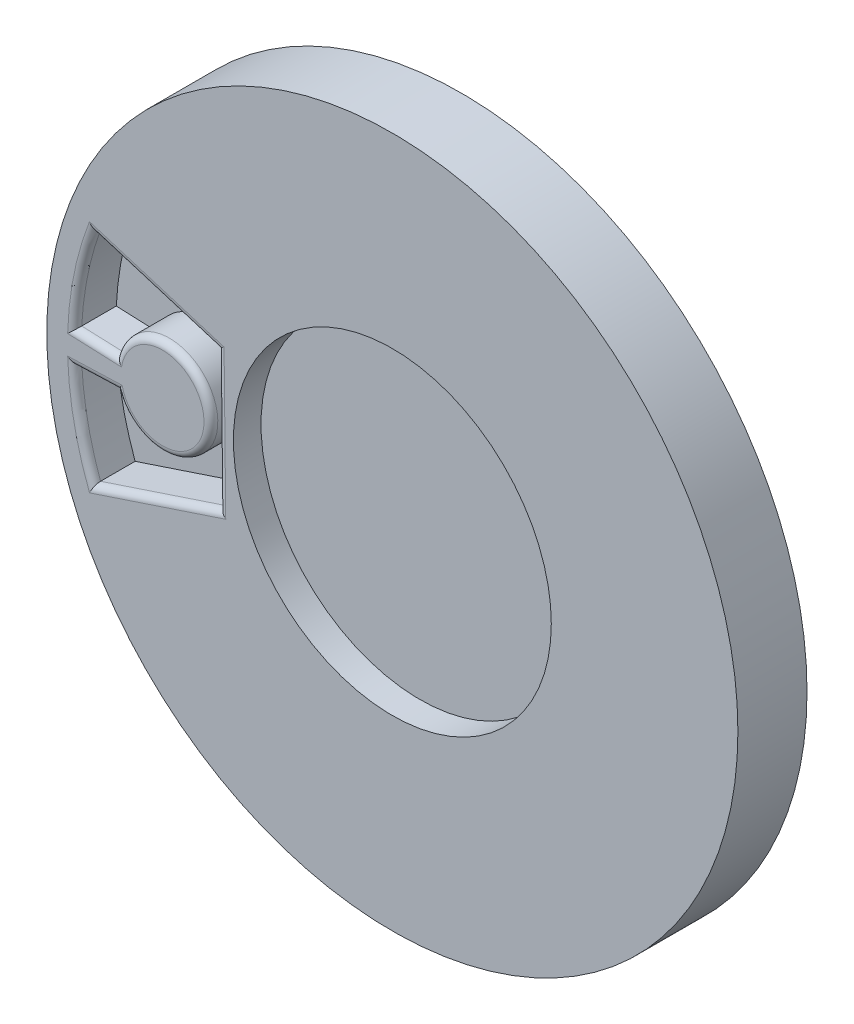
ISO-10303-21;
HEADER;
FILE_DESCRIPTION(('STEP AP214'),'2;1');
FILE_NAME('part.step','',(''),(''),'','','');
FILE_SCHEMA(('AUTOMOTIVE_DESIGN { 1 0 10303 214 1 1 1 1 }'));
ENDSEC;
DATA;
#1=APPLICATION_CONTEXT('core data for automotive mechanical design processes');
#2=APPLICATION_PROTOCOL_DEFINITION('international standard','automotive_design',2000,#1);
#3=PRODUCT_CONTEXT('',#1,'mechanical');
#4=PRODUCT('Part','Part','',(#3));
#5=PRODUCT_RELATED_PRODUCT_CATEGORY('part','',(#4));
#6=PRODUCT_DEFINITION_FORMATION('','',#4);
#7=PRODUCT_DEFINITION_CONTEXT('part definition',#1,'design');
#8=PRODUCT_DEFINITION('design','',#6,#7);
#9=PRODUCT_DEFINITION_SHAPE('','',#8);
#10=(LENGTH_UNIT() NAMED_UNIT(*) SI_UNIT(.MILLI.,.METRE.));
#11=(NAMED_UNIT(*) PLANE_ANGLE_UNIT() SI_UNIT($,.RADIAN.));
#12=(NAMED_UNIT(*) SI_UNIT($,.STERADIAN.) SOLID_ANGLE_UNIT());
#13=UNCERTAINTY_MEASURE_WITH_UNIT(LENGTH_MEASURE(1.E-05),#10,'distance_accuracy_value','');
#14=(GEOMETRIC_REPRESENTATION_CONTEXT(3) GLOBAL_UNCERTAINTY_ASSIGNED_CONTEXT((#13)) GLOBAL_UNIT_ASSIGNED_CONTEXT((#10,
#11,#12)) REPRESENTATION_CONTEXT('',''));
#15=CARTESIAN_POINT('',(0.,0.,0.));
#16=DIRECTION('',(0.,0.,1.));
#17=DIRECTION('',(1.,0.,0.));
#18=AXIS2_PLACEMENT_3D('',#15,#16,#17);
#19=CARTESIAN_POINT('',(0.,0.,-10.));
#20=DIRECTION('',(0.,0.,1.));
#21=DIRECTION('',(1.,0.,0.));
#22=AXIS2_PLACEMENT_3D('',#19,#20,#21);
#23=CYLINDRICAL_SURFACE('',#22,4.);
#24=CARTESIAN_POINT('',(0.,0.,0.));
#25=DIRECTION('',(0.,0.,1.));
#26=DIRECTION('',(1.,0.,0.));
#27=AXIS2_PLACEMENT_3D('',#24,#25,#26);
#28=CIRCLE('',#27,4.);
#29=CARTESIAN_POINT('',(4.,0.,0.));
#30=VERTEX_POINT('',#29);
#31=EDGE_CURVE('E181',#30,#30,#28,.T.);
#32=ORIENTED_EDGE('',*,*,#31,.F.);
#33=EDGE_LOOP('',(#32));
#34=FACE_BOUND('',#33,.T.);
#35=CARTESIAN_POINT('',(0.,0.,-10.));
#36=DIRECTION('',(0.,0.,1.));
#37=DIRECTION('',(1.,0.,0.));
#38=AXIS2_PLACEMENT_3D('',#35,#36,#37);
#39=CIRCLE('',#38,4.);
#40=CARTESIAN_POINT('',(-0.600000000000001,3.95474398665704,-10.));
#41=VERTEX_POINT('',#40);
#42=CARTESIAN_POINT('',(-0.6,-3.95474398665704,-10.));
#43=VERTEX_POINT('',#42);
#44=EDGE_CURVE('E180',#41,#43,#39,.T.);
#45=ORIENTED_EDGE('',*,*,#44,.T.);
#46=DIRECTION('',(0.,0.,1.));
#47=VECTOR('',#46,1.);
#48=CARTESIAN_POINT('',(-0.6,-3.95474398665704,-10.));
#49=LINE('',#48,#47);
#50=CARTESIAN_POINT('',(-0.6,-3.95474398665704,-5.));
#51=VERTEX_POINT('',#50);
#52=EDGE_CURVE('E176',#43,#51,#49,.T.);
#53=ORIENTED_EDGE('',*,*,#52,.T.);
#54=CARTESIAN_POINT('',(0.,0.,-5.));
#55=DIRECTION('',(0.,0.,1.));
#56=DIRECTION('',(1.,0.,0.));
#57=AXIS2_PLACEMENT_3D('',#54,#55,#56);
#58=CIRCLE('',#57,4.);
#59=CARTESIAN_POINT('',(0.6,-3.95474398665704,-5.));
#60=VERTEX_POINT('',#59);
#61=EDGE_CURVE('E174',#60,#51,#58,.F.);
#62=ORIENTED_EDGE('',*,*,#61,.F.);
#63=DIRECTION('',(0.,0.,1.));
#64=VECTOR('',#63,1.);
#65=CARTESIAN_POINT('',(0.6,-3.95474398665704,-10.));
#66=LINE('',#65,#64);
#67=CARTESIAN_POINT('',(0.6,-3.95474398665704,-10.));
#68=VERTEX_POINT('',#67);
#69=EDGE_CURVE('E158',#60,#68,#66,.F.);
#70=ORIENTED_EDGE('',*,*,#69,.T.);
#71=CARTESIAN_POINT('',(0.6,3.95474398665704,-10.));
#72=VERTEX_POINT('',#71);
#73=EDGE_CURVE('E172',#68,#72,#39,.T.);
#74=ORIENTED_EDGE('',*,*,#73,.T.);
#75=DIRECTION('',(0.,0.,1.));
#76=VECTOR('',#75,1.);
#77=CARTESIAN_POINT('',(0.6,3.95474398665704,-10.));
#78=LINE('',#77,#76);
#79=CARTESIAN_POINT('',(0.6,3.95474398665704,-5.));
#80=VERTEX_POINT('',#79);
#81=EDGE_CURVE('E161',#72,#80,#78,.T.);
#82=ORIENTED_EDGE('',*,*,#81,.T.);
#83=CARTESIAN_POINT('',(-0.600000000000001,3.95474398665704,-5.));
#84=VERTEX_POINT('',#83);
#85=EDGE_CURVE('E263',#84,#80,#58,.F.);
#86=ORIENTED_EDGE('',*,*,#85,.F.);
#87=DIRECTION('',(0.,0.,1.));
#88=VECTOR('',#87,1.);
#89=CARTESIAN_POINT('',(-0.600000000000001,3.95474398665704,-10.));
#90=LINE('',#89,#88);
#91=EDGE_CURVE('E187',#84,#41,#90,.F.);
#92=ORIENTED_EDGE('',*,*,#91,.T.);
#93=EDGE_LOOP('',(#45,#53,#62,#70,#74,#82,#86,#92));
#94=FACE_BOUND('',#93,.T.);
#95=ADVANCED_FACE('F39',(#34,#94),#23,.T.);
#96=CARTESIAN_POINT('',(0.,0.,-10.));
#97=DIRECTION('',(0.,0.,1.));
#98=DIRECTION('',(1.,0.,0.));
#99=AXIS2_PLACEMENT_3D('',#96,#97,#98);
#100=PLANE('',#99);
#101=DIRECTION('',(0.,1.,0.));
#102=VECTOR('',#101,1.);
#103=CARTESIAN_POINT('',(-0.6,0.,-10.));
#104=LINE('',#103,#102);
#105=EDGE_CURVE('E166',#43,#41,#104,.T.);
#106=ORIENTED_EDGE('',*,*,#105,.F.);
#107=ORIENTED_EDGE('',*,*,#44,.F.);
#108=EDGE_LOOP('',(#106,#107));
#109=FACE_BOUND('',#108,.T.);
#110=ADVANCED_FACE('F394',(#109),#100,.F.);
#111=DIRECTION('',(0.,-1.,0.));
#112=VECTOR('',#111,1.);
#113=CARTESIAN_POINT('',(0.6,0.,-10.));
#114=LINE('',#113,#112);
#115=EDGE_CURVE('E154',#72,#68,#114,.T.);
#116=ORIENTED_EDGE('',*,*,#115,.F.);
#117=ORIENTED_EDGE('',*,*,#73,.F.);
#118=EDGE_LOOP('',(#116,#117));
#119=FACE_BOUND('',#118,.T.);
#120=ADVANCED_FACE('F178',(#119),#100,.F.);
#121=CARTESIAN_POINT('',(0.,0.,5.));
#122=DIRECTION('',(0.,0.,-1.));
#123=DIRECTION('',(-1.,0.,0.));
#124=AXIS2_PLACEMENT_3D('',#121,#122,#123);
#125=CYLINDRICAL_SURFACE('',#124,25.);
#126=CARTESIAN_POINT('',(0.,0.,5.));
#127=DIRECTION('',(0.,0.,1.));
#128=DIRECTION('',(1.,0.,0.));
#129=AXIS2_PLACEMENT_3D('',#126,#127,#128);
#130=CIRCLE('',#129,25.);
#131=CARTESIAN_POINT('',(25.,0.,5.));
#132=VERTEX_POINT('',#131);
#133=EDGE_CURVE('E167',#132,#132,#130,.T.);
#134=ORIENTED_EDGE('',*,*,#133,.F.);
#135=EDGE_LOOP('',(#134));
#136=FACE_BOUND('',#135,.T.);
#137=CARTESIAN_POINT('',(0.,0.,0.));
#138=DIRECTION('',(0.,0.,1.));
#139=DIRECTION('',(1.,0.,0.));
#140=AXIS2_PLACEMENT_3D('',#137,#138,#139);
#141=CIRCLE('',#140,25.);
#142=CARTESIAN_POINT('',(25.,0.,0.));
#143=VERTEX_POINT('',#142);
#144=EDGE_CURVE('E230',#143,#143,#141,.T.);
#145=ORIENTED_EDGE('',*,*,#144,.T.);
#146=EDGE_LOOP('',(#145));
#147=FACE_BOUND('',#146,.T.);
#148=ADVANCED_FACE('F452',(#136,#147),#125,.T.);
#149=CARTESIAN_POINT('',(0.,0.,5.));
#150=DIRECTION('',(0.,0.,1.));
#151=DIRECTION('',(1.,0.,0.));
#152=AXIS2_PLACEMENT_3D('',#149,#150,#151);
#153=PLANE('',#152);
#154=DIRECTION('',(0.99937595988947,0.0353226668727015,0.));
#155=VECTOR('',#154,1.);
#156=CARTESIAN_POINT('',(-0.00386320509487539,0.109300759024079,5.));
#157=LINE('',#156,#155);
#158=CARTESIAN_POINT('',(-23.4889439182314,-0.720772922756677,5.));
#159=VERTEX_POINT('',#158);
#160=CARTESIAN_POINT('',(-19.5506470447787,-0.581574909106081,5.));
#161=VERTEX_POINT('',#160);
#162=EDGE_CURVE('E284',#159,#161,#157,.T.);
#163=ORIENTED_EDGE('',*,*,#162,.T.);
#164=CARTESIAN_POINT('',(-16.6259035290733,0.0861640873133168,5.));
#165=DIRECTION('',(0.,0.,1.));
#166=DIRECTION('',(1.,0.,0.));
#167=AXIS2_PLACEMENT_3D('',#164,#165,#166);
#168=CIRCLE('',#167,2.99999999999999);
#169=CARTESIAN_POINT('',(-19.5922113636635,0.534514207697872,5.));
#170=VERTEX_POINT('',#169);
#171=EDGE_CURVE('E287',#161,#170,#168,.T.);
#172=ORIENTED_EDGE('',*,*,#171,.T.);
#173=DIRECTION('',(-0.999179311302841,0.0405056028763893,0.));
#174=VECTOR('',#173,1.);
#175=CARTESIAN_POINT('',(-0.0105119652507558,-0.259305810895904,5.));
#176=LINE('',#175,#174);
#177=CARTESIAN_POINT('',(-23.489793934411,0.692517811258058,5.));
#178=VERTEX_POINT('',#177);
#179=EDGE_CURVE('E281',#170,#178,#176,.T.);
#180=ORIENTED_EDGE('',*,*,#179,.T.);
#181=CARTESIAN_POINT('',(0.,0.,5.));
#182=DIRECTION('',(0.,0.,1.));
#183=DIRECTION('',(1.,0.,0.));
#184=AXIS2_PLACEMENT_3D('',#181,#182,#183);
#185=CIRCLE('',#184,23.5);
#186=CARTESIAN_POINT('',(-21.9119208469225,8.49221554120022,5.));
#187=VERTEX_POINT('',#186);
#188=EDGE_CURVE('E278',#178,#187,#185,.F.);
#189=ORIENTED_EDGE('',*,*,#188,.T.);
#190=DIRECTION('',(0.956004923655791,-0.29335061947418,0.));
#191=VECTOR('',#190,1.);
#192=CARTESIAN_POINT('',(0.495975025405774,1.61634077046822,5.));
#193=LINE('',#192,#191);
#194=CARTESIAN_POINT('',(-12.1740696553525,5.50415072196194,5.));
#195=VERTEX_POINT('',#194);
#196=EDGE_CURVE('E275',#187,#195,#193,.T.);
#197=ORIENTED_EDGE('',*,*,#196,.T.);
#198=DIRECTION('',(0.0114073310418733,-0.999934934282477,0.));
#199=VECTOR('',#198,1.);
#200=CARTESIAN_POINT('',(-12.1097018936724,-0.138148367042147,5.));
#201=LINE('',#200,#199);
#202=CARTESIAN_POINT('',(-12.0516362821989,-5.22801848474846,5.));
#203=VERTEX_POINT('',#202);
#204=EDGE_CURVE('E272',#195,#203,#201,.T.);
#205=ORIENTED_EDGE('',*,*,#204,.T.);
#206=DIRECTION('',(-0.949040740195132,-0.315153412562639,0.));
#207=VECTOR('',#206,1.);
#208=CARTESIAN_POINT('',(0.36667728654571,-1.10419773216613,5.));
#209=LINE('',#208,#207);
#210=CARTESIAN_POINT('',(-21.9084288457623,-8.50122023654084,5.));
#211=VERTEX_POINT('',#210);
#212=EDGE_CURVE('E269',#203,#211,#209,.T.);
#213=ORIENTED_EDGE('',*,*,#212,.T.);
#214=CARTESIAN_POINT('',(0.,0.,5.));
#215=DIRECTION('',(0.,0.,1.));
#216=DIRECTION('',(1.,0.,0.));
#217=AXIS2_PLACEMENT_3D('',#214,#215,#216);
#218=CIRCLE('',#217,23.5);
#219=EDGE_CURVE('E266',#211,#159,#218,.F.);
#220=ORIENTED_EDGE('',*,*,#219,.T.);
#221=EDGE_LOOP('',(#163,#172,#180,#189,#197,#205,#213,#220));
#222=FACE_BOUND('',#221,.T.);
#223=CARTESIAN_POINT('',(0.,0.,5.));
#224=DIRECTION('',(0.,0.,1.));
#225=DIRECTION('',(1.,0.,0.));
#226=AXIS2_PLACEMENT_3D('',#223,#224,#225);
#227=CIRCLE('',#226,11.5);
#228=CARTESIAN_POINT('',(11.5,0.,5.));
#229=VERTEX_POINT('',#228);
#230=EDGE_CURVE('E185',#229,#229,#227,.T.);
#231=ORIENTED_EDGE('',*,*,#230,.F.);
#232=EDGE_LOOP('',(#231));
#233=FACE_BOUND('',#232,.T.);
#234=ORIENTED_EDGE('',*,*,#133,.T.);
#235=EDGE_LOOP('',(#234));
#236=FACE_BOUND('',#235,.T.);
#237=ADVANCED_FACE('F449',(#222,#233,#236),#153,.T.);
#238=CARTESIAN_POINT('',(0.,0.,0.));
#239=DIRECTION('',(0.,0.,1.));
#240=DIRECTION('',(1.,0.,0.));
#241=AXIS2_PLACEMENT_3D('',#238,#239,#240);
#242=PLANE('',#241);
#243=ORIENTED_EDGE('',*,*,#31,.T.);
#244=EDGE_LOOP('',(#243));
#245=FACE_BOUND('',#244,.T.);
#246=ORIENTED_EDGE('',*,*,#144,.F.);
#247=EDGE_LOOP('',(#246));
#248=FACE_BOUND('',#247,.T.);
#249=ADVANCED_FACE('F447',(#245,#248),#242,.F.);
#250=CARTESIAN_POINT('',(0.,0.,2.));
#251=DIRECTION('',(0.,0.,1.));
#252=DIRECTION('',(1.,0.,0.));
#253=AXIS2_PLACEMENT_3D('',#250,#251,#252);
#254=CYLINDRICAL_SURFACE('',#253,23.);
#255=DIRECTION('',(0.,0.,1.));
#256=VECTOR('',#255,1.);
#257=CARTESIAN_POINT('',(-21.6093275166906,7.87635475816069,2.));
#258=LINE('',#257,#256);
#259=CARTESIAN_POINT('',(-21.6093275166906,7.87635475816069,2.));
#260=VERTEX_POINT('',#259);
#261=CARTESIAN_POINT('',(-21.6093275166906,7.87635475816069,4.5));
#262=VERTEX_POINT('',#261);
#263=EDGE_CURVE('E226',#260,#262,#258,.T.);
#264=ORIENTED_EDGE('',*,*,#263,.T.);
#265=CARTESIAN_POINT('',(0.,0.,4.5));
#266=DIRECTION('',(0.,0.,1.));
#267=DIRECTION('',(1.,0.,0.));
#268=AXIS2_PLACEMENT_3D('',#265,#266,#267);
#269=CIRCLE('',#268,23.);
#270=CARTESIAN_POINT('',(-22.9701271209983,1.17186178586794,4.5));
#271=VERTEX_POINT('',#270);
#272=EDGE_CURVE('E301',#262,#271,#269,.T.);
#273=ORIENTED_EDGE('',*,*,#272,.T.);
#274=DIRECTION('',(0.,0.,1.));
#275=VECTOR('',#274,1.);
#276=CARTESIAN_POINT('',(-22.9701271209983,1.17186178586794,2.));
#277=LINE('',#276,#275);
#278=CARTESIAN_POINT('',(-22.9701271209983,1.17186178586794,2.));
#279=VERTEX_POINT('',#278);
#280=EDGE_CURVE('E225',#279,#271,#277,.T.);
#281=ORIENTED_EDGE('',*,*,#280,.F.);
#282=CARTESIAN_POINT('',(0.,0.,2.));
#283=DIRECTION('',(0.,0.,1.));
#284=DIRECTION('',(1.,0.,0.));
#285=AXIS2_PLACEMENT_3D('',#282,#283,#284);
#286=CIRCLE('',#285,23.);
#287=EDGE_CURVE('E196',#260,#279,#286,.T.);
#288=ORIENTED_EDGE('',*,*,#287,.F.);
#289=EDGE_LOOP('',(#264,#273,#281,#288));
#290=FACE_BOUND('',#289,.T.);
#291=ADVANCED_FACE('F423',(#290),#254,.F.);
#292=CARTESIAN_POINT('',(0.349299715668684,1.13833830864033,2.));
#293=DIRECTION('',(-0.29335061947418,-0.956004923655791,0.));
#294=DIRECTION('',(0.956004923655791,-0.29335061947418,0.));
#295=AXIS2_PLACEMENT_3D('',#292,#293,#294);
#296=PLANE('',#295);
#297=DIRECTION('',(0.,0.,1.));
#298=VECTOR('',#297,1.);
#299=CARTESIAN_POINT('',(-12.6698712453566,5.13327784498954,2.));
#300=LINE('',#299,#298);
#301=CARTESIAN_POINT('',(-12.6698712453566,5.13327784498954,2.));
#302=VERTEX_POINT('',#301);
#303=CARTESIAN_POINT('',(-12.6698712453566,5.13327784498954,4.5));
#304=VERTEX_POINT('',#303);
#305=EDGE_CURVE('E231',#302,#304,#300,.T.);
#306=ORIENTED_EDGE('',*,*,#305,.T.);
#307=DIRECTION('',(0.956004923655791,-0.29335061947418,0.));
#308=VECTOR('',#307,1.);
#309=CARTESIAN_POINT('',(0.349299715668684,1.13833830864033,4.5));
#310=LINE('',#309,#308);
#311=EDGE_CURVE('E304',#304,#262,#310,.F.);
#312=ORIENTED_EDGE('',*,*,#311,.T.);
#313=ORIENTED_EDGE('',*,*,#263,.F.);
#314=DIRECTION('',(0.956004923655791,-0.29335061947418,0.));
#315=VECTOR('',#314,1.);
#316=CARTESIAN_POINT('',(0.349299715668684,1.13833830864033,2.));
#317=LINE('',#316,#315);
#318=EDGE_CURVE('E222',#260,#302,#317,.T.);
#319=ORIENTED_EDGE('',*,*,#318,.T.);
#320=EDGE_LOOP('',(#306,#312,#313,#319));
#321=FACE_BOUND('',#320,.T.);
#322=ADVANCED_FACE('F419',(#321),#296,.T.);
#323=CARTESIAN_POINT('',(-12.6096693608136,-0.143852032563084,2.));
#324=DIRECTION('',(-0.999934934282477,-0.0114073310418733,0.));
#325=DIRECTION('',(0.0114073310418733,-0.999934934282477,0.));
#326=AXIS2_PLACEMENT_3D('',#323,#324,#325);
#327=PLANE('',#326);
#328=DIRECTION('',(0.,0.,1.));
#329=VECTOR('',#328,1.);
#330=CARTESIAN_POINT('',(-12.5557693056403,-4.86858106248694,2.));
#331=LINE('',#330,#329);
#332=CARTESIAN_POINT('',(-12.5557693056403,-4.86858106248694,2.));
#333=VERTEX_POINT('',#332);
#334=CARTESIAN_POINT('',(-12.5557693056403,-4.86858106248694,4.5));
#335=VERTEX_POINT('',#334);
#336=EDGE_CURVE('E235',#333,#335,#331,.T.);
#337=ORIENTED_EDGE('',*,*,#336,.T.);
#338=DIRECTION('',(0.0114073310418733,-0.999934934282477,0.));
#339=VECTOR('',#338,1.);
#340=CARTESIAN_POINT('',(-12.6096693608136,-0.143852032563084,4.5));
#341=LINE('',#340,#339);
#342=EDGE_CURVE('E307',#335,#304,#341,.F.);
#343=ORIENTED_EDGE('',*,*,#342,.T.);
#344=ORIENTED_EDGE('',*,*,#305,.F.);
#345=DIRECTION('',(0.0114073310418733,-0.999934934282477,0.));
#346=VECTOR('',#345,1.);
#347=CARTESIAN_POINT('',(-12.6096693608136,-0.143852032563084,2.));
#348=LINE('',#347,#346);
#349=EDGE_CURVE('E219',#302,#333,#348,.T.);
#350=ORIENTED_EDGE('',*,*,#349,.T.);
#351=EDGE_LOOP('',(#337,#343,#344,#350));
#352=FACE_BOUND('',#351,.T.);
#353=ADVANCED_FACE('F422',(#352),#327,.T.);
#354=CARTESIAN_POINT('',(0.20910058026439,-0.629677362068565,2.));
#355=DIRECTION('',(-0.315153412562639,0.949040740195132,0.));
#356=DIRECTION('',(-0.949040740195132,-0.315153412562639,0.));
#357=AXIS2_PLACEMENT_3D('',#354,#355,#356);
#358=PLANE('',#357);
#359=DIRECTION('',(0.,0.,1.));
#360=VECTOR('',#359,1.);
#361=CARTESIAN_POINT('',(-21.6097523035312,-7.87518922820458,2.));
#362=LINE('',#361,#360);
#363=CARTESIAN_POINT('',(-21.6097523035312,-7.87518922820458,2.));
#364=VERTEX_POINT('',#363);
#365=CARTESIAN_POINT('',(-21.6097523035312,-7.87518922820458,4.5));
#366=VERTEX_POINT('',#365);
#367=EDGE_CURVE('E238',#364,#366,#362,.T.);
#368=ORIENTED_EDGE('',*,*,#367,.T.);
#369=DIRECTION('',(-0.949040740195132,-0.315153412562639,0.));
#370=VECTOR('',#369,1.);
#371=CARTESIAN_POINT('',(0.20910058026439,-0.629677362068565,4.5));
#372=LINE('',#371,#370);
#373=EDGE_CURVE('E49',#366,#335,#372,.F.);
#374=ORIENTED_EDGE('',*,*,#373,.T.);
#375=ORIENTED_EDGE('',*,*,#336,.F.);
#376=DIRECTION('',(-0.949040740195132,-0.315153412562639,0.));
#377=VECTOR('',#376,1.);
#378=CARTESIAN_POINT('',(0.20910058026439,-0.629677362068565,2.));
#379=LINE('',#378,#377);
#380=EDGE_CURVE('E216',#333,#364,#379,.T.);
#381=ORIENTED_EDGE('',*,*,#380,.T.);
#382=EDGE_LOOP('',(#368,#374,#375,#381));
#383=FACE_BOUND('',#382,.T.);
#384=ADVANCED_FACE('F427',(#383),#358,.T.);
#385=CARTESIAN_POINT('',(0.,0.,2.));
#386=DIRECTION('',(0.,0.,1.));
#387=DIRECTION('',(1.,0.,0.));
#388=AXIS2_PLACEMENT_3D('',#385,#386,#387);
#389=CYLINDRICAL_SURFACE('',#388,23.);
#390=DIRECTION('',(0.,0.,1.));
#391=VECTOR('',#390,1.);
#392=CARTESIAN_POINT('',(-22.9685335503022,-1.20269137713875,2.));
#393=LINE('',#392,#391);
#394=CARTESIAN_POINT('',(-22.9685335503022,-1.20269137713875,2.));
#395=VERTEX_POINT('',#394);
#396=CARTESIAN_POINT('',(-22.9685335503022,-1.20269137713875,4.5));
#397=VERTEX_POINT('',#396);
#398=EDGE_CURVE('E241',#395,#397,#393,.T.);
#399=ORIENTED_EDGE('',*,*,#398,.T.);
#400=CARTESIAN_POINT('',(0.,0.,4.5));
#401=DIRECTION('',(0.,0.,1.));
#402=DIRECTION('',(1.,0.,0.));
#403=AXIS2_PLACEMENT_3D('',#400,#401,#402);
#404=CIRCLE('',#403,23.);
#405=EDGE_CURVE('E11',#397,#366,#404,.T.);
#406=ORIENTED_EDGE('',*,*,#405,.T.);
#407=ORIENTED_EDGE('',*,*,#367,.F.);
#408=CARTESIAN_POINT('',(0.,0.,2.));
#409=DIRECTION('',(0.,0.,1.));
#410=DIRECTION('',(1.,0.,0.));
#411=AXIS2_PLACEMENT_3D('',#408,#409,#410);
#412=CIRCLE('',#411,23.);
#413=EDGE_CURVE('E212',#395,#364,#412,.T.);
#414=ORIENTED_EDGE('',*,*,#413,.F.);
#415=EDGE_LOOP('',(#399,#406,#407,#414));
#416=FACE_BOUND('',#415,.T.);
#417=ADVANCED_FACE('F431',(#416),#389,.F.);
#418=CARTESIAN_POINT('',(0.0137981283414754,-0.390387220920656,2.));
#419=DIRECTION('',(0.0353226668727015,-0.99937595988947,0.));
#420=DIRECTION('',(0.99937595988947,0.0353226668727015,0.));
#421=AXIS2_PLACEMENT_3D('',#418,#419,#420);
#422=PLANE('',#421);
#423=DIRECTION('',(0.,0.,1.));
#424=VECTOR('',#423,1.);
#425=CARTESIAN_POINT('',(-19.9205871040752,-1.09496255306556,2.));
#426=LINE('',#425,#424);
#427=CARTESIAN_POINT('',(-19.9205871040752,-1.09496255306556,2.));
#428=VERTEX_POINT('',#427);
#429=CARTESIAN_POINT('',(-19.9205871040752,-1.09496255306556,4.5));
#430=VERTEX_POINT('',#429);
#431=EDGE_CURVE('E244',#428,#430,#426,.T.);
#432=ORIENTED_EDGE('',*,*,#431,.T.);
#433=DIRECTION('',(0.99937595988947,0.0353226668727015,0.));
#434=VECTOR('',#433,1.);
#435=CARTESIAN_POINT('',(0.0137981283414754,-0.390387220920656,4.5));
#436=LINE('',#435,#434);
#437=EDGE_CURVE('E295',#430,#397,#436,.F.);
#438=ORIENTED_EDGE('',*,*,#437,.T.);
#439=ORIENTED_EDGE('',*,*,#398,.F.);
#440=DIRECTION('',(0.99937595988947,0.0353226668727016,0.));
#441=VECTOR('',#440,1.);
#442=CARTESIAN_POINT('',(0.0137981283414754,-0.390387220920656,2.));
#443=LINE('',#442,#441);
#444=EDGE_CURVE('E209',#395,#428,#443,.T.);
#445=ORIENTED_EDGE('',*,*,#444,.T.);
#446=EDGE_LOOP('',(#432,#438,#439,#445));
#447=FACE_BOUND('',#446,.T.);
#448=ADVANCED_FACE('F434',(#447),#422,.T.);
#449=CARTESIAN_POINT('',(-16.6259035290733,0.0861640873133168,2.));
#450=DIRECTION('',(0.,0.,1.));
#451=DIRECTION('',(1.,0.,0.));
#452=AXIS2_PLACEMENT_3D('',#449,#450,#451);
#453=CYLINDRICAL_SURFACE('',#452,3.49999999999999);
#454=DIRECTION('',(0.,0.,1.));
#455=VECTOR('',#454,1.);
#456=CARTESIAN_POINT('',(-19.9902715827964,1.05106180162684,2.));
#457=LINE('',#456,#455);
#458=CARTESIAN_POINT('',(-19.9902715827964,1.05106180162684,2.));
#459=VERTEX_POINT('',#458);
#460=CARTESIAN_POINT('',(-19.9902715827964,1.05106180162684,4.5));
#461=VERTEX_POINT('',#460);
#462=EDGE_CURVE('E248',#459,#461,#457,.T.);
#463=ORIENTED_EDGE('',*,*,#462,.T.);
#464=CARTESIAN_POINT('',(-16.6259035290733,0.0861640873133168,4.5));
#465=DIRECTION('',(0.,0.,1.));
#466=DIRECTION('',(1.,0.,0.));
#467=AXIS2_PLACEMENT_3D('',#464,#465,#466);
#468=CIRCLE('',#467,3.49999999999999);
#469=EDGE_CURVE('E291',#461,#430,#468,.F.);
#470=ORIENTED_EDGE('',*,*,#469,.T.);
#471=ORIENTED_EDGE('',*,*,#431,.F.);
#472=CARTESIAN_POINT('',(-16.6259035290733,0.0861640873133168,2.));
#473=DIRECTION('',(0.,0.,1.));
#474=DIRECTION('',(1.,0.,0.));
#475=AXIS2_PLACEMENT_3D('',#472,#473,#474);
#476=CIRCLE('',#475,3.49999999999999);
#477=EDGE_CURVE('E206',#428,#459,#476,.T.);
#478=ORIENTED_EDGE('',*,*,#477,.T.);
#479=EDGE_LOOP('',(#463,#470,#471,#478));
#480=FACE_BOUND('',#479,.T.);
#481=ADVANCED_FACE('F437',(#480),#453,.T.);
#482=CARTESIAN_POINT('',(0.00974083618743883,0.240283844755516,2.));
#483=DIRECTION('',(0.0405056028763893,0.999179311302841,0.));
#484=DIRECTION('',(-0.999179311302841,0.0405056028763893,0.));
#485=AXIS2_PLACEMENT_3D('',#482,#483,#484);
#486=PLANE('',#485);
#487=ORIENTED_EDGE('',*,*,#280,.T.);
#488=DIRECTION('',(-0.999179311302841,0.0405056028763893,0.));
#489=VECTOR('',#488,1.);
#490=CARTESIAN_POINT('',(0.00974083618743883,0.240283844755516,4.5));
#491=LINE('',#490,#489);
#492=EDGE_CURVE('E298',#271,#461,#491,.F.);
#493=ORIENTED_EDGE('',*,*,#492,.T.);
#494=ORIENTED_EDGE('',*,*,#462,.F.);
#495=DIRECTION('',(-0.999179311302841,0.0405056028763893,0.));
#496=VECTOR('',#495,1.);
#497=CARTESIAN_POINT('',(0.00974083618743883,0.240283844755516,2.));
#498=LINE('',#497,#496);
#499=EDGE_CURVE('E203',#459,#279,#498,.T.);
#500=ORIENTED_EDGE('',*,*,#499,.T.);
#501=EDGE_LOOP('',(#487,#493,#494,#500));
#502=FACE_BOUND('',#501,.T.);
#503=ADVANCED_FACE('F417',(#502),#486,.T.);
#504=CARTESIAN_POINT('',(0.,0.,2.));
#505=DIRECTION('',(0.,0.,1.));
#506=DIRECTION('',(1.,0.,0.));
#507=AXIS2_PLACEMENT_3D('',#504,#505,#506);
#508=PLANE('',#507);
#509=ORIENTED_EDGE('',*,*,#287,.T.);
#510=ORIENTED_EDGE('',*,*,#499,.F.);
#511=ORIENTED_EDGE('',*,*,#477,.F.);
#512=ORIENTED_EDGE('',*,*,#444,.F.);
#513=ORIENTED_EDGE('',*,*,#413,.T.);
#514=ORIENTED_EDGE('',*,*,#380,.F.);
#515=ORIENTED_EDGE('',*,*,#349,.F.);
#516=ORIENTED_EDGE('',*,*,#318,.F.);
#517=EDGE_LOOP('',(#509,#510,#511,#512,#513,#514,#515,#516));
#518=FACE_BOUND('',#517,.T.);
#519=ADVANCED_FACE('F413',(#518),#508,.T.);
#520=CARTESIAN_POINT('',(0.,0.,3.));
#521=DIRECTION('',(0.,0.,1.));
#522=DIRECTION('',(1.,0.,0.));
#523=AXIS2_PLACEMENT_3D('',#520,#521,#522);
#524=CYLINDRICAL_SURFACE('',#523,11.5);
#525=CARTESIAN_POINT('',(0.,0.,3.));
#526=DIRECTION('',(0.,0.,1.));
#527=DIRECTION('',(1.,0.,0.));
#528=AXIS2_PLACEMENT_3D('',#525,#526,#527);
#529=CIRCLE('',#528,11.5);
#530=CARTESIAN_POINT('',(11.5,0.,3.));
#531=VERTEX_POINT('',#530);
#532=EDGE_CURVE('E192',#531,#531,#529,.T.);
#533=ORIENTED_EDGE('',*,*,#532,.F.);
#534=EDGE_LOOP('',(#533));
#535=FACE_BOUND('',#534,.T.);
#536=ORIENTED_EDGE('',*,*,#230,.T.);
#537=EDGE_LOOP('',(#536));
#538=FACE_BOUND('',#537,.T.);
#539=ADVANCED_FACE('F409',(#535,#538),#524,.F.);
#540=CARTESIAN_POINT('',(0.,0.,3.));
#541=DIRECTION('',(0.,0.,1.));
#542=DIRECTION('',(1.,0.,0.));
#543=AXIS2_PLACEMENT_3D('',#540,#541,#542);
#544=PLANE('',#543);
#545=ORIENTED_EDGE('',*,*,#532,.T.);
#546=EDGE_LOOP('',(#545));
#547=FACE_BOUND('',#546,.T.);
#548=ADVANCED_FACE('F405',(#547),#544,.T.);
#549=CARTESIAN_POINT('',(-0.6,0.,-5.));
#550=DIRECTION('',(1.,0.,0.));
#551=DIRECTION('',(0.,1.,0.));
#552=AXIS2_PLACEMENT_3D('',#549,#550,#551);
#553=PLANE('',#552);
#554=DIRECTION('',(0.,-1.,0.));
#555=VECTOR('',#554,1.);
#556=CARTESIAN_POINT('',(-0.6,0.,-5.));
#557=LINE('',#556,#555);
#558=EDGE_CURVE('E653',#84,#51,#557,.T.);
#559=ORIENTED_EDGE('',*,*,#558,.T.);
#560=ORIENTED_EDGE('',*,*,#52,.F.);
#561=ORIENTED_EDGE('',*,*,#105,.T.);
#562=ORIENTED_EDGE('',*,*,#91,.F.);
#563=EDGE_LOOP('',(#559,#560,#561,#562));
#564=FACE_BOUND('',#563,.T.);
#565=ADVANCED_FACE('F408',(#564),#553,.T.);
#566=CARTESIAN_POINT('',(0.6,0.,-5.));
#567=DIRECTION('',(-1.,0.,0.));
#568=DIRECTION('',(0.,0.,1.));
#569=AXIS2_PLACEMENT_3D('',#566,#567,#568);
#570=PLANE('',#569);
#571=DIRECTION('',(0.,1.,0.));
#572=VECTOR('',#571,1.);
#573=CARTESIAN_POINT('',(0.6,0.,-5.));
#574=LINE('',#573,#572);
#575=EDGE_CURVE('E657',#60,#80,#574,.T.);
#576=ORIENTED_EDGE('',*,*,#575,.T.);
#577=ORIENTED_EDGE('',*,*,#81,.F.);
#578=ORIENTED_EDGE('',*,*,#115,.T.);
#579=ORIENTED_EDGE('',*,*,#69,.F.);
#580=EDGE_LOOP('',(#576,#577,#578,#579));
#581=FACE_BOUND('',#580,.T.);
#582=ADVANCED_FACE('F157',(#581),#570,.T.);
#583=CARTESIAN_POINT('',(0.,0.,-5.));
#584=DIRECTION('',(0.,0.,1.));
#585=DIRECTION('',(1.,0.,0.));
#586=AXIS2_PLACEMENT_3D('',#583,#584,#585);
#587=PLANE('',#586);
#588=ORIENTED_EDGE('',*,*,#61,.T.);
#589=ORIENTED_EDGE('',*,*,#558,.F.);
#590=ORIENTED_EDGE('',*,*,#85,.T.);
#591=ORIENTED_EDGE('',*,*,#575,.F.);
#592=EDGE_LOOP('',(#588,#589,#590,#591));
#593=FACE_BOUND('',#592,.T.);
#594=ADVANCED_FACE('F390',(#593),#587,.F.);
#595=CARTESIAN_POINT('',(-12.1097018936724,-0.138148367042147,4.5));
#596=DIRECTION('',(0.0114073310418733,-0.999934934282477,0.));
#597=DIRECTION('',(0.999934934282477,0.0114073310418733,0.));
#598=AXIS2_PLACEMENT_3D('',#595,#596,#597);
#599=CYLINDRICAL_SURFACE('',#598,0.5);
#600=CARTESIAN_POINT('',(-12.1740696553525,5.50415072196194,4.5));
#601=DIRECTION('',(0.598988285459809,-0.800757787275227,0.));
#602=DIRECTION('',(0.800757787275227,0.59898828545981,0.));
#603=AXIS2_PLACEMENT_3D('',#600,#601,#602);
#604=ELLIPSE('',#603,0.61916549284049,0.5);
#605=EDGE_CURVE('E380',#304,#195,#604,.F.);
#606=ORIENTED_EDGE('',*,*,#605,.F.);
#607=ORIENTED_EDGE('',*,*,#342,.F.);
#608=CARTESIAN_POINT('',(-12.0516362821989,-5.22801848474846,4.5));
#609=DIRECTION('',(-0.58053469802616,-0.814235509166528,0.));
#610=DIRECTION('',(0.814235509166528,-0.58053469802616,0.));
#611=AXIS2_PLACEMENT_3D('',#608,#609,#610);
#612=ELLIPSE('',#611,0.619148904421419,0.5);
#613=EDGE_CURVE('E43',#203,#335,#612,.T.);
#614=ORIENTED_EDGE('',*,*,#613,.F.);
#615=ORIENTED_EDGE('',*,*,#204,.F.);
#616=EDGE_LOOP('',(#606,#607,#614,#615));
#617=FACE_BOUND('',#616,.T.);
#618=ADVANCED_FACE('F41',(#617),#599,.T.);
#619=CARTESIAN_POINT('',(0.36667728654571,-1.10419773216613,4.5));
#620=DIRECTION('',(-0.949040740195132,-0.315153412562639,0.));
#621=DIRECTION('',(0.315153412562639,-0.949040740195132,0.));
#622=AXIS2_PLACEMENT_3D('',#619,#620,#621);
#623=CYLINDRICAL_SURFACE('',#622,0.5);
#624=ORIENTED_EDGE('',*,*,#613,.T.);
#625=ORIENTED_EDGE('',*,*,#373,.F.);
#626=CARTESIAN_POINT('',(-21.6097523035312,-7.87518922820458,4.5));
#627=CARTESIAN_POINT('',(-21.609728946291,-7.8751417345328,4.52265081240066));
#628=CARTESIAN_POINT('',(-21.6106848114522,-7.87711789713747,4.54524596877298));
#629=CARTESIAN_POINT('',(-21.6143521588077,-7.88470447798913,4.58948151476364));
#630=CARTESIAN_POINT('',(-21.6170487289331,-7.89028402734469,4.61112836167282));
#631=CARTESIAN_POINT('',(-21.6239915254084,-7.90465762350987,4.65297364345229));
#632=CARTESIAN_POINT('',(-21.6282336503612,-7.91344316276806,4.67317574401784));
#633=CARTESIAN_POINT('',(-21.6380079684643,-7.93370121453001,4.71187710185904));
#634=CARTESIAN_POINT('',(-21.6435429867255,-7.94517961146033,4.73037250454111));
#635=CARTESIAN_POINT('',(-21.6580475888471,-7.97528576915517,4.77240980097854));
#636=CARTESIAN_POINT('',(-21.6675087138887,-7.9949435210882,4.79504400385287));
#637=CARTESIAN_POINT('',(-21.6878575108861,-8.03728537039115,4.83651268798172));
#638=CARTESIAN_POINT('',(-21.6987478390588,-8.05997510425798,4.85533992412025));
#639=CARTESIAN_POINT('',(-21.7256535543055,-8.11612283417839,4.89550020389447));
#640=CARTESIAN_POINT('',(-21.7420940033833,-8.1504992357473,4.91526069861426));
#641=CARTESIAN_POINT('',(-21.7760499317532,-8.22166848957567,4.94843487096826));
#642=CARTESIAN_POINT('',(-21.7935665078091,-8.25846380990936,4.96184194793087));
#643=CARTESIAN_POINT('',(-21.8269728652059,-8.32880836968523,4.98139582935085));
#644=CARTESIAN_POINT('',(-21.8427983773458,-8.36220159316814,4.98823185910058));
#645=CARTESIAN_POINT('',(-21.8746033710845,-8.42945783596213,4.99743628627961));
#646=CARTESIAN_POINT('',(-21.8905824681079,-8.46331974511778,4.99981386290844));
#647=CARTESIAN_POINT('',(-21.9071580967148,-8.49852121476951,4.99999649422305));
#648=CARTESIAN_POINT('',(-21.9077935063622,-8.49987074240978,4.99999999632483));
#649=CARTESIAN_POINT('',(-21.9084288457623,-8.50122023654084,5.));
#650=B_SPLINE_CURVE_WITH_KNOTS('',3,(#626,#627,#628,#629,#630,#631,#632,#633,#634,#635,#636,
#637,#638,#639,#640,#641,#642,#643,#644,#645,#646,#647,#648,#649),.UNSPECIFIED.,.F.,.F.,(4,2,2,
2,2,2,2,2,2,2,2,4),(0.,0.067758052444645,0.134943210740638,0.20195136492114,0.269107331950061,
0.362897065916551,0.456863647036185,0.584951130381086,0.713171395779429,0.825651369654292,
0.937899510981133,0.942374404066135),.UNSPECIFIED.);
#651=EDGE_CURVE('E373',#211,#366,#650,.F.);
#652=ORIENTED_EDGE('',*,*,#651,.F.);
#653=ORIENTED_EDGE('',*,*,#212,.F.);
#654=EDGE_LOOP('',(#624,#625,#652,#653));
#655=FACE_BOUND('',#654,.T.);
#656=ADVANCED_FACE('F381',(#655),#623,.T.);
#657=CARTESIAN_POINT('',(0.495975025405774,1.61634077046822,4.5));
#658=DIRECTION('',(0.956004923655791,-0.29335061947418,0.));
#659=DIRECTION('',(0.29335061947418,0.956004923655791,0.));
#660=AXIS2_PLACEMENT_3D('',#657,#658,#659);
#661=CYLINDRICAL_SURFACE('',#660,0.5);
#662=ORIENTED_EDGE('',*,*,#605,.T.);
#663=ORIENTED_EDGE('',*,*,#196,.F.);
#664=CARTESIAN_POINT('',(-21.6093275166906,7.87635475816069,4.5));
#665=CARTESIAN_POINT('',(-21.6093039761085,7.87630824995779,4.52279493125339));
#666=CARTESIAN_POINT('',(-21.6102836007648,7.87827590598945,4.54553579688987));
#667=CARTESIAN_POINT('',(-21.6140454578014,7.88583644970608,4.5900675749161));
#668=CARTESIAN_POINT('',(-21.6168127880488,7.89139936781888,4.61186476521712));
#669=CARTESIAN_POINT('',(-21.6239432114351,7.90574085630941,4.65401077084165));
#670=CARTESIAN_POINT('',(-21.6283022571613,7.91451127075493,4.6743631047304));
#671=CARTESIAN_POINT('',(-21.6383529822395,7.93474818850497,4.71335339967739));
#672=CARTESIAN_POINT('',(-21.644047494135,7.94622042263066,4.73198759785338));
#673=CARTESIAN_POINT('',(-21.6589123546121,7.97619344317041,4.77414318681677));
#674=CARTESIAN_POINT('',(-21.6685760919475,7.99569828193318,4.79677642350685));
#675=CARTESIAN_POINT('',(-21.6893685963001,8.03772487248295,4.83824189181944));
#676=CARTESIAN_POINT('',(-21.7005000420148,8.06025214182539,4.85706701013404));
#677=CARTESIAN_POINT('',(-21.7278517685832,8.11569166745525,4.89696319713256));
#678=CARTESIAN_POINT('',(-21.7444914271108,8.14948283791717,4.91652191723406));
#679=CARTESIAN_POINT('',(-21.778866986392,8.21945040161557,4.94934638521881));
#680=CARTESIAN_POINT('',(-21.7966039427782,8.25562909402149,4.9626059633012));
#681=CARTESIAN_POINT('',(-21.8302648192102,8.32444901522338,4.98180948371188));
#682=CARTESIAN_POINT('',(-21.8461181448873,8.35692499595875,4.98848920367785));
#683=CARTESIAN_POINT('',(-21.8779823782476,8.42233344014095,4.99748684038317));
#684=CARTESIAN_POINT('',(-21.8939928953134,8.45526482879977,4.99981368925402));
#685=CARTESIAN_POINT('',(-21.9106178519736,8.48952967053789,4.99999641493316));
#686=CARTESIAN_POINT('',(-21.9112693848397,8.49087262296014,4.99999999682804));
#687=CARTESIAN_POINT('',(-21.9119208469225,8.49221554120022,5.));
#688=B_SPLINE_CURVE_WITH_KNOTS('',3,(#664,#665,#666,#667,#668,#669,#670,#671,#672,#673,#674,
#675,#676,#677,#678,#679,#680,#681,#682,#683,#684,#685,#686,#687),.UNSPECIFIED.,.F.,.F.,(4,2,2,
2,2,2,2,2,2,2,2,4),(0.,0.0681933323019259,0.135825421535092,0.203286720078022,0.270892420208936,
0.364581029057396,0.458443057968802,0.585091068933125,0.711862872967908,0.821862591916685,
0.93163634177871,0.936114296578806),.UNSPECIFIED.);
#689=EDGE_CURVE('E354',#262,#187,#688,.T.);
#690=ORIENTED_EDGE('',*,*,#689,.F.);
#691=ORIENTED_EDGE('',*,*,#311,.F.);
#692=EDGE_LOOP('',(#662,#663,#690,#691));
#693=FACE_BOUND('',#692,.T.);
#694=ADVANCED_FACE('F369',(#693),#661,.T.);
#695=CARTESIAN_POINT('',(0.,0.,4.5));
#696=DIRECTION('',(0.,0.,1.));
#697=DIRECTION('',(1.,0.,0.));
#698=AXIS2_PLACEMENT_3D('',#695,#696,#697);
#699=TOROIDAL_SURFACE('',#698,23.5,0.5);
#700=ORIENTED_EDGE('',*,*,#651,.T.);
#701=ORIENTED_EDGE('',*,*,#405,.F.);
#702=CARTESIAN_POINT('',(-22.9685335503022,-1.20269137713875,4.5));
#703=CARTESIAN_POINT('',(-22.9684930668077,-1.20272797523858,4.52236018281104));
#704=CARTESIAN_POINT('',(-22.9701083968692,-1.20124886044787,4.54466136768104));
#705=CARTESIAN_POINT('',(-22.9762963734648,-1.19557990184899,4.58829867101542));
#706=CARTESIAN_POINT('',(-22.9808425070643,-1.19141436014795,4.60964162442446));
#707=CARTESIAN_POINT('',(-22.9925321014112,-1.18069858566499,4.6508782503904));
#708=CARTESIAN_POINT('',(-22.9996680828101,-1.17415521984861,4.67077590029841));
#709=CARTESIAN_POINT('',(-23.0160928336956,-1.15908546967285,4.70889095535911));
#710=CARTESIAN_POINT('',(-23.025386604845,-1.15055447791948,4.72710431709935));
#711=CARTESIAN_POINT('',(-23.0499423011549,-1.12799820205164,4.76889023545745));
#712=CARTESIAN_POINT('',(-23.0660742346613,-1.11316763196222,4.791516056615));
#713=CARTESIAN_POINT('',(-23.1007684578952,-1.08123433209013,4.83297172472678));
#714=CARTESIAN_POINT('',(-23.1193354322043,-1.06412722169583,4.85179407245668));
#715=CARTESIAN_POINT('',(-23.1657659396498,-1.0212920918746,4.89248428266158));
#716=CARTESIAN_POINT('',(-23.1944209058251,-0.994813188555976,4.91265424309116));
#717=CARTESIAN_POINT('',(-23.2536478763488,-0.939977735250429,4.94653860001053));
#718=CARTESIAN_POINT('',(-23.284222060101,-0.911619048518041,4.96024550129216));
#719=CARTESIAN_POINT('',(-23.3432036190401,-0.856802837253454,4.98052814817883));
#720=CARTESIAN_POINT('',(-23.3715106662061,-0.830449537421247,4.98769209582835));
#721=CARTESIAN_POINT('',(-23.4284532087077,-0.777342094589788,4.99733024276578));
#722=CARTESIAN_POINT('',(-23.4570879013644,-0.750588895971552,4.99981413480012));
#723=CARTESIAN_POINT('',(-23.4867673048199,-0.722810339602223,4.99999664704214));
#724=CARTESIAN_POINT('',(-23.4878556497168,-0.721791629924749,4.9999999953284));
#725=CARTESIAN_POINT('',(-23.4889439182314,-0.720772922756677,5.));
#726=B_SPLINE_CURVE_WITH_KNOTS('',3,(#702,#703,#704,#705,#706,#707,#708,#709,#710,#711,#712,
#713,#714,#715,#716,#717,#718,#719,#720,#721,#722,#723,#724,#725),.UNSPECIFIED.,.F.,.F.,(4,2,2,
2,2,2,2,2,2,2,2,4),(0.,0.0668799721965129,0.133163259797121,0.199256628334163,0.265504755539125,
0.359475239927988,0.453629233845797,0.584686982952152,0.715896348140733,0.833618255138087,
0.951096082083172,0.955568253540869),.UNSPECIFIED.);
#727=EDGE_CURVE('E346',#159,#397,#726,.F.);
#728=ORIENTED_EDGE('',*,*,#727,.F.);
#729=ORIENTED_EDGE('',*,*,#219,.F.);
#730=EDGE_LOOP('',(#700,#701,#728,#729));
#731=FACE_BOUND('',#730,.T.);
#732=ADVANCED_FACE('F366',(#731),#699,.T.);
#733=CARTESIAN_POINT('',(0.,0.,4.5));
#734=DIRECTION('',(0.,0.,1.));
#735=DIRECTION('',(1.,0.,0.));
#736=AXIS2_PLACEMENT_3D('',#733,#734,#735);
#737=TOROIDAL_SURFACE('',#736,23.5,0.5);
#738=ORIENTED_EDGE('',*,*,#689,.T.);
#739=ORIENTED_EDGE('',*,*,#188,.F.);
#740=CARTESIAN_POINT('',(-22.9701271209983,1.17186178586794,4.5));
#741=CARTESIAN_POINT('',(-22.970086743896,1.17189814521442,4.52240178431062));
#742=CARTESIAN_POINT('',(-22.9717053933702,1.17042170035413,4.54474506095161));
#743=CARTESIAN_POINT('',(-22.977907732148,1.1647614771181,4.58846807426799));
#744=CARTESIAN_POINT('',(-22.9824650428889,1.16060178449417,4.60985459041257));
#745=CARTESIAN_POINT('',(-22.9941860428527,1.14989863223142,4.65117853432402));
#746=CARTESIAN_POINT('',(-23.0013423160096,1.14336195518327,4.67111989350237));
#747=CARTESIAN_POINT('',(-23.0178171148476,1.12830456763751,4.70931918559062));
#748=CARTESIAN_POINT('',(-23.0271406221943,1.1197792859171,4.72757310248463));
#749=CARTESIAN_POINT('',(-23.05174740262,1.09726327587117,4.76939606617318));
#750=CARTESIAN_POINT('',(-23.0678976634086,1.08247317359163,4.79202394045652));
#751=CARTESIAN_POINT('',(-23.1026351051358,1.05062365005243,4.83348308509536));
#752=CARTESIAN_POINT('',(-23.1212269610315,1.03355987441762,4.85230689159958));
#753=CARTESIAN_POINT('',(-23.1676430483135,0.990903862689148,4.89292146470255));
#754=CARTESIAN_POINT('',(-23.1962518897962,0.964570216597444,4.91303260648019));
#755=CARTESIAN_POINT('',(-23.2553867919312,0.910033224832503,4.94681490631617));
#756=CARTESIAN_POINT('',(-23.2859150002827,0.881827782658304,4.96047869928496));
#757=CARTESIAN_POINT('',(-23.3447193845658,0.827390367294714,4.98065516474762));
#758=CARTESIAN_POINT('',(-23.372892471582,0.801264973431782,4.98777110548169));
#759=CARTESIAN_POINT('',(-23.4295661942501,0.748617096307315,4.99734576497471));
#760=CARTESIAN_POINT('',(-23.4580660303868,0.722095547842085,4.99981410171996));
#761=CARTESIAN_POINT('',(-23.4876132126047,0.694550939426727,4.99999662571142));
#762=CARTESIAN_POINT('',(-23.4887036117895,0.693534373972987,4.99999999546957));
#763=CARTESIAN_POINT('',(-23.489793934411,0.692517811258058,5.));
#764=B_SPLINE_CURVE_WITH_KNOTS('',3,(#740,#741,#742,#743,#744,#745,#746,#747,#748,#749,#750,
#751,#752,#753,#754,#755,#756,#757,#758,#759,#760,#761,#762,#763),.UNSPECIFIED.,.F.,.F.,(4,2,2,
2,2,2,2,2,2,2,2,4),(0.,0.0670056890162933,0.133418127373574,0.199642529823073,0.266020689770392,
0.35996717078454,0.454096229086994,0.58472304563064,0.715498723809585,0.832449774549797,
0.94915853373612,0.953630817482974),.UNSPECIFIED.);
#765=EDGE_CURVE('E355',#271,#178,#764,.T.);
#766=ORIENTED_EDGE('',*,*,#765,.F.);
#767=ORIENTED_EDGE('',*,*,#272,.F.);
#768=EDGE_LOOP('',(#738,#739,#766,#767));
#769=FACE_BOUND('',#768,.T.);
#770=ADVANCED_FACE('F340',(#769),#737,.T.);
#771=CARTESIAN_POINT('',(-0.00386320509487539,0.109300759024079,4.5));
#772=DIRECTION('',(0.99937595988947,0.0353226668727015,0.));
#773=DIRECTION('',(-0.0353226668727015,0.99937595988947,0.));
#774=AXIS2_PLACEMENT_3D('',#771,#772,#773);
#775=CYLINDRICAL_SURFACE('',#774,0.5);
#776=ORIENTED_EDGE('',*,*,#727,.T.);
#777=ORIENTED_EDGE('',*,*,#437,.F.);
#778=CARTESIAN_POINT('',(-19.9205871040752,-1.09496255306556,4.5));
#779=CARTESIAN_POINT('',(-19.9206090897374,-1.09499892797513,4.5242208331163));
#780=CARTESIAN_POINT('',(-19.9193660806419,-1.09316088647568,4.548405809508));
#781=CARTESIAN_POINT('',(-19.9145326141728,-1.08603540134376,4.59588858815264));
#782=CARTESIAN_POINT('',(-19.9109551986356,-1.08076712208202,4.61919056276605));
#783=CARTESIAN_POINT('',(-19.9016381363069,-1.06708387699676,4.66434505635376));
#784=CARTESIAN_POINT('',(-19.8959013885717,-1.05867313026955,4.68619947271938));
#785=CARTESIAN_POINT('',(-19.8825287356015,-1.03914152710337,4.72805012752835));
#786=CARTESIAN_POINT('',(-19.8748906427947,-1.0280175492853,4.74804418890339));
#787=CARTESIAN_POINT('',(-19.8574589155998,-1.00274673857933,4.78706764072022));
#788=CARTESIAN_POINT('',(-19.8475582345699,-0.988451494243368,4.80595226240379));
#789=CARTESIAN_POINT('',(-19.8262636909125,-0.957879666909745,4.84107201842857));
#790=CARTESIAN_POINT('',(-19.8148694325366,-0.941602558865582,4.85730644798791));
#791=CARTESIAN_POINT('',(-19.7887086992069,-0.904467735727321,4.88976823038202));
#792=CARTESIAN_POINT('',(-19.7737048979045,-0.883313762104585,4.90546434954442));
#793=CARTESIAN_POINT('',(-19.7424180271845,-0.839566491711973,4.93314825606404));
#794=CARTESIAN_POINT('',(-19.7261336498593,-0.816971727973229,4.94513218867121));
#795=CARTESIAN_POINT('',(-19.6891281153703,-0.766081093904942,4.96761783725049));
#796=CARTESIAN_POINT('',(-19.6681893356373,-0.737578041019362,4.97729084454283));
#797=CARTESIAN_POINT('',(-19.6254307212992,-0.680037596536306,4.9915935862472));
#798=CARTESIAN_POINT('',(-19.6036118543134,-0.651000809904464,4.99622871086446));
#799=CARTESIAN_POINT('',(-19.5722077461533,-0.609703370431922,4.99939539061499));
#800=CARTESIAN_POINT('',(-19.5628178878109,-0.597417218254088,4.99990495449318));
#801=CARTESIAN_POINT('',(-19.5524805400875,-0.583959993659651,4.99999596673027));
#802=CARTESIAN_POINT('',(-19.5515639345767,-0.582767340878621,4.99999999833944));
#803=CARTESIAN_POINT('',(-19.5506470447787,-0.58157490910608,5.));
#804=B_SPLINE_CURVE_WITH_KNOTS('',3,(#778,#779,#780,#781,#782,#783,#784,#785,#786,#787,#788,
#789,#790,#791,#792,#793,#794,#795,#796,#797,#798,#799,#800,#801,#802,#803),.UNSPECIFIED.,.F.,
.F.,(4,2,2,2,2,2,2,2,2,2,2,2,4),(0.,0.0725045017640621,0.144607364728353,0.21661376779035,
0.288703403078227,0.365429934295867,0.4421768367482,0.532790079937739,0.623497103293765,
0.733098307447409,0.842582129686698,0.888978035286268,0.893490601957148),.UNSPECIFIED.);
#805=EDGE_CURVE('E321',#161,#430,#804,.F.);
#806=ORIENTED_EDGE('',*,*,#805,.F.);
#807=ORIENTED_EDGE('',*,*,#162,.F.);
#808=EDGE_LOOP('',(#776,#777,#806,#807));
#809=FACE_BOUND('',#808,.T.);
#810=ADVANCED_FACE('F335',(#809),#775,.T.);
#811=CARTESIAN_POINT('',(-0.0105119652507558,-0.259305810895904,4.5));
#812=DIRECTION('',(-0.999179311302841,0.0405056028763893,0.));
#813=DIRECTION('',(-0.0405056028763893,-0.999179311302841,0.));
#814=AXIS2_PLACEMENT_3D('',#811,#812,#813);
#815=CYLINDRICAL_SURFACE('',#814,0.5);
#816=ORIENTED_EDGE('',*,*,#765,.T.);
#817=ORIENTED_EDGE('',*,*,#179,.F.);
#818=CARTESIAN_POINT('',(-19.9902715827964,1.05106180162684,4.5));
#819=CARTESIAN_POINT('',(-19.990295685979,1.05109901610166,4.52380688055473));
#820=CARTESIAN_POINT('',(-19.9890074426753,1.04931142850908,4.5475746611373));
#821=CARTESIAN_POINT('',(-19.9840079579127,1.04239543069209,4.59421610558228));
#822=CARTESIAN_POINT('',(-19.980311313117,1.03728714671319,4.61709428157511));
#823=CARTESIAN_POINT('',(-19.97069992075,1.0240422605997,4.66140824339184));
#824=CARTESIAN_POINT('',(-19.9647886235155,1.01591036926806,4.68284621204478));
#825=CARTESIAN_POINT('',(-19.9510328251709,0.997059511801789,4.72390036017611));
#826=CARTESIAN_POINT('',(-19.9431859323281,0.986337345315787,4.74351424410668));
#827=CARTESIAN_POINT('',(-19.9252654221543,0.961963417852375,4.78190675286829));
#828=CARTESIAN_POINT('',(-19.9150754647921,0.948160493249614,4.80053419240487));
#829=CARTESIAN_POINT('',(-19.8931856986903,0.918679046587398,4.83522505044259));
#830=CARTESIAN_POINT('',(-19.8814851920783,0.902999657849236,4.85128727609613));
#831=CARTESIAN_POINT('',(-19.8508761649468,0.86224400235108,4.88802128551312));
#832=CARTESIAN_POINT('',(-19.8312307978589,0.836307958953677,4.9071325248795));
#833=CARTESIAN_POINT('',(-19.7900368360032,0.782509179722685,4.93983612331121));
#834=CARTESIAN_POINT('',(-19.7684840741068,0.754642255769877,4.95341601656184));
#835=CARTESIAN_POINT('',(-19.7221903281606,0.695480435922275,4.97626408967671));
#836=CARTESIAN_POINT('',(-19.6973344346595,0.664096503435194,4.98506266288173));
#837=CARTESIAN_POINT('',(-19.64673585969,0.601062804857176,4.99681742260038));
#838=CARTESIAN_POINT('',(-19.6209951757613,0.569413745732809,4.99978598957411));
#839=CARTESIAN_POINT('',(-19.5941148415877,0.536820467239195,4.999996277949));
#840=CARTESIAN_POINT('',(-19.5931632224482,0.535667187291508,4.99999999726568));
#841=CARTESIAN_POINT('',(-19.5922113636635,0.534514207697872,5.));
#842=B_SPLINE_CURVE_WITH_KNOTS('',3,(#818,#819,#820,#821,#822,#823,#824,#825,#826,#827,#828,
#829,#830,#831,#832,#833,#834,#835,#836,#837,#838,#839,#840,#841),.UNSPECIFIED.,.F.,.F.,(4,2,2,
2,2,2,2,2,2,2,2,4),(0.,0.0712571246047204,0.142086347100088,0.212805676406719,0.283612832189403,
0.359309093555831,0.435040452516977,0.547625086146867,0.660462062634216,0.782975208013666,
0.905227904914647,0.909713506333456),.UNSPECIFIED.);
#843=EDGE_CURVE('E312',#461,#170,#842,.T.);
#844=ORIENTED_EDGE('',*,*,#843,.F.);
#845=ORIENTED_EDGE('',*,*,#492,.F.);
#846=EDGE_LOOP('',(#816,#817,#844,#845));
#847=FACE_BOUND('',#846,.T.);
#848=ADVANCED_FACE('F328',(#847),#815,.T.);
#849=CARTESIAN_POINT('',(-16.6259035290733,0.0861640873133168,4.5));
#850=DIRECTION('',(0.,0.,1.));
#851=DIRECTION('',(1.,0.,0.));
#852=AXIS2_PLACEMENT_3D('',#849,#850,#851);
#853=TOROIDAL_SURFACE('',#852,2.99999999999999,0.5);
#854=ORIENTED_EDGE('',*,*,#805,.T.);
#855=ORIENTED_EDGE('',*,*,#469,.F.);
#856=ORIENTED_EDGE('',*,*,#843,.T.);
#857=ORIENTED_EDGE('',*,*,#171,.F.);
#858=EDGE_LOOP('',(#854,#855,#856,#857));
#859=FACE_BOUND('',#858,.T.);
#860=ADVANCED_FACE('F331',(#859),#853,.T.);
#861=CLOSED_SHELL('',(#95,#110,#120,#148,#237,#249,#291,#322,#353,#384,#417,#448,#481,#503,#519,
#539,#548,#565,#582,#594,#618,#656,#694,#732,#770,#810,#848,#860));
#862=MANIFOLD_SOLID_BREP('B2',#861);
#863=ADVANCED_BREP_SHAPE_REPRESENTATION('',(#18,#862),#14);
#864=SHAPE_DEFINITION_REPRESENTATION(#9,#863);
ENDSEC;
END-ISO-10303-21;
